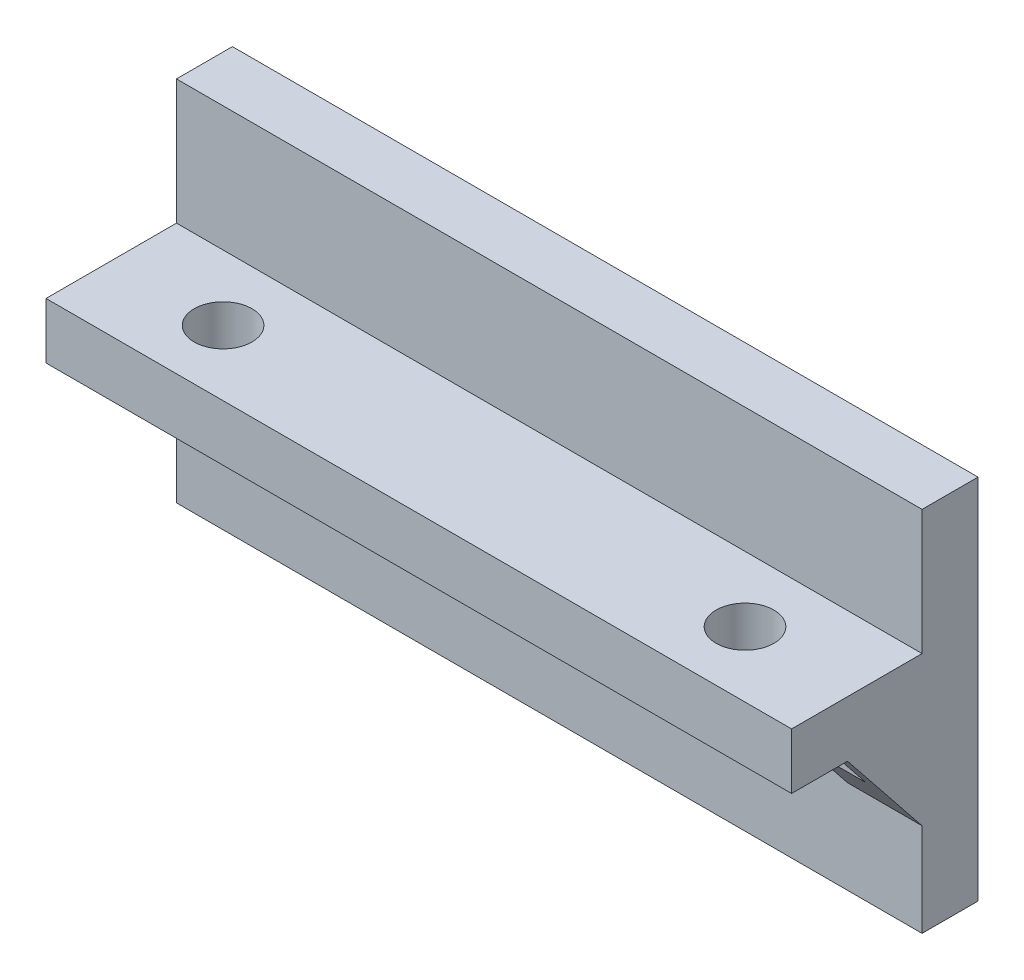
ISO-10303-21;
HEADER;
FILE_DESCRIPTION(('STEP AP214'),'2;1');
FILE_NAME('part.step','',(''),(''),'','','');
FILE_SCHEMA(('AUTOMOTIVE_DESIGN { 1 0 10303 214 1 1 1 1 }'));
ENDSEC;
DATA;
#1=APPLICATION_CONTEXT('core data for automotive mechanical design processes');
#2=APPLICATION_PROTOCOL_DEFINITION('international standard','automotive_design',2000,#1);
#3=PRODUCT_CONTEXT('',#1,'mechanical');
#4=PRODUCT('Part','Part','',(#3));
#5=PRODUCT_RELATED_PRODUCT_CATEGORY('part','',(#4));
#6=PRODUCT_DEFINITION_FORMATION('','',#4);
#7=PRODUCT_DEFINITION_CONTEXT('part definition',#1,'design');
#8=PRODUCT_DEFINITION('design','',#6,#7);
#9=PRODUCT_DEFINITION_SHAPE('','',#8);
#10=(LENGTH_UNIT() NAMED_UNIT(*) SI_UNIT(.MILLI.,.METRE.));
#11=(NAMED_UNIT(*) PLANE_ANGLE_UNIT() SI_UNIT($,.RADIAN.));
#12=(NAMED_UNIT(*) SI_UNIT($,.STERADIAN.) SOLID_ANGLE_UNIT());
#13=UNCERTAINTY_MEASURE_WITH_UNIT(LENGTH_MEASURE(1.E-05),#10,'distance_accuracy_value','');
#14=(GEOMETRIC_REPRESENTATION_CONTEXT(3) GLOBAL_UNCERTAINTY_ASSIGNED_CONTEXT((#13)) GLOBAL_UNIT_ASSIGNED_CONTEXT((#10,
#11,#12)) REPRESENTATION_CONTEXT('',''));
#15=CARTESIAN_POINT('',(0.,0.,0.));
#16=DIRECTION('',(0.,0.,1.));
#17=DIRECTION('',(1.,0.,0.));
#18=AXIS2_PLACEMENT_3D('',#15,#16,#17);
#19=CARTESIAN_POINT('',(0.,10.,10.));
#20=DIRECTION('',(0.,1.,0.));
#21=DIRECTION('',(0.,0.,1.));
#22=AXIS2_PLACEMENT_3D('',#19,#20,#21);
#23=PLANE('',#22);
#24=CARTESIAN_POINT('',(34.,10.,6.50000000000001));
#25=DIRECTION('',(0.,1.,0.));
#26=DIRECTION('',(0.,0.,1.));
#27=AXIS2_PLACEMENT_3D('',#24,#25,#26);
#28=CIRCLE('',#27,1.55);
#29=CARTESIAN_POINT('',(34.,10.,8.05000000000001));
#30=VERTEX_POINT('',#29);
#31=EDGE_CURVE('E313',#30,#30,#28,.T.);
#32=ORIENTED_EDGE('',*,*,#31,.T.);
#33=EDGE_LOOP('',(#32));
#34=FACE_BOUND('',#33,.T.);
#35=CARTESIAN_POINT('',(6.,10.,6.50000000000001));
#36=DIRECTION('',(0.,1.,0.));
#37=DIRECTION('',(0.,0.,1.));
#38=AXIS2_PLACEMENT_3D('',#35,#36,#37);
#39=CIRCLE('',#38,1.55);
#40=CARTESIAN_POINT('',(6.,10.,8.05000000000001));
#41=VERTEX_POINT('',#40);
#42=EDGE_CURVE('E257',#41,#41,#39,.T.);
#43=ORIENTED_EDGE('',*,*,#42,.T.);
#44=EDGE_LOOP('',(#43));
#45=FACE_BOUND('',#44,.T.);
#46=DIRECTION('',(0.,0.,1.));
#47=VECTOR('',#46,1.);
#48=CARTESIAN_POINT('',(39.,10.,0.));
#49=LINE('',#48,#47);
#50=CARTESIAN_POINT('',(39.,10.,5.));
#51=VERTEX_POINT('',#50);
#52=CARTESIAN_POINT('',(39.,10.,7.));
#53=VERTEX_POINT('',#52);
#54=EDGE_CURVE('E361',#51,#53,#49,.T.);
#55=ORIENTED_EDGE('',*,*,#54,.T.);
#56=DIRECTION('',(1.,0.,0.));
#57=VECTOR('',#56,1.);
#58=CARTESIAN_POINT('',(0.,10.,7.));
#59=LINE('',#58,#57);
#60=CARTESIAN_POINT('',(40.,10.,7.));
#61=VERTEX_POINT('',#60);
#62=EDGE_CURVE('E363',#53,#61,#59,.T.);
#63=ORIENTED_EDGE('',*,*,#62,.T.);
#64=DIRECTION('',(0.,0.,-1.));
#65=VECTOR('',#64,1.);
#66=CARTESIAN_POINT('',(40.,10.,10.));
#67=LINE('',#66,#65);
#68=CARTESIAN_POINT('',(40.,10.,10.));
#69=VERTEX_POINT('',#68);
#70=EDGE_CURVE('E212',#69,#61,#67,.T.);
#71=ORIENTED_EDGE('',*,*,#70,.F.);
#72=DIRECTION('',(1.,0.,0.));
#73=VECTOR('',#72,1.);
#74=CARTESIAN_POINT('',(0.,10.,10.));
#75=LINE('',#74,#73);
#76=CARTESIAN_POINT('',(0.,10.,10.));
#77=VERTEX_POINT('',#76);
#78=EDGE_CURVE('E199',#77,#69,#75,.T.);
#79=ORIENTED_EDGE('',*,*,#78,.F.);
#80=DIRECTION('',(0.,0.,-1.));
#81=VECTOR('',#80,1.);
#82=CARTESIAN_POINT('',(0.,10.,10.));
#83=LINE('',#82,#81);
#84=CARTESIAN_POINT('',(0.,10.,7.));
#85=VERTEX_POINT('',#84);
#86=EDGE_CURVE('E190',#77,#85,#83,.T.);
#87=ORIENTED_EDGE('',*,*,#86,.T.);
#88=DIRECTION('',(-1.,0.,0.));
#89=VECTOR('',#88,1.);
#90=CARTESIAN_POINT('',(0.,10.,7.));
#91=LINE('',#90,#89);
#92=CARTESIAN_POINT('',(1.,10.,7.));
#93=VERTEX_POINT('',#92);
#94=EDGE_CURVE('E175',#93,#85,#91,.T.);
#95=ORIENTED_EDGE('',*,*,#94,.F.);
#96=DIRECTION('',(0.,0.,1.));
#97=VECTOR('',#96,1.);
#98=CARTESIAN_POINT('',(1.,10.,0.));
#99=LINE('',#98,#97);
#100=CARTESIAN_POINT('',(1.,10.,5.));
#101=VERTEX_POINT('',#100);
#102=EDGE_CURVE('E184',#101,#93,#99,.T.);
#103=ORIENTED_EDGE('',*,*,#102,.F.);
#104=DIRECTION('',(1.,0.,0.));
#105=VECTOR('',#104,1.);
#106=CARTESIAN_POINT('',(0.,10.,5.));
#107=LINE('',#106,#105);
#108=CARTESIAN_POINT('',(4.,10.,5.));
#109=VERTEX_POINT('',#108);
#110=EDGE_CURVE('E348',#101,#109,#107,.T.);
#111=ORIENTED_EDGE('',*,*,#110,.T.);
#112=DIRECTION('',(0.,0.,-1.));
#113=VECTOR('',#112,1.);
#114=CARTESIAN_POINT('',(4.,10.,0.));
#115=LINE('',#114,#113);
#116=CARTESIAN_POINT('',(4.,10.,3.));
#117=VERTEX_POINT('',#116);
#118=EDGE_CURVE('E350',#109,#117,#115,.T.);
#119=ORIENTED_EDGE('',*,*,#118,.T.);
#120=DIRECTION('',(1.,0.,0.));
#121=VECTOR('',#120,1.);
#122=CARTESIAN_POINT('',(0.,10.,3.));
#123=LINE('',#122,#121);
#124=CARTESIAN_POINT('',(17.5,10.,3.));
#125=VERTEX_POINT('',#124);
#126=EDGE_CURVE('E291',#117,#125,#123,.T.);
#127=ORIENTED_EDGE('',*,*,#126,.T.);
#128=DIRECTION('',(0.,0.,-1.));
#129=VECTOR('',#128,1.);
#130=CARTESIAN_POINT('',(17.5,10.,0.));
#131=LINE('',#130,#129);
#132=CARTESIAN_POINT('',(17.5,10.,5.));
#133=VERTEX_POINT('',#132);
#134=EDGE_CURVE('E332',#133,#125,#131,.T.);
#135=ORIENTED_EDGE('',*,*,#134,.F.);
#136=DIRECTION('',(1.,0.,0.));
#137=VECTOR('',#136,1.);
#138=CARTESIAN_POINT('',(0.,10.,5.));
#139=LINE('',#138,#137);
#140=CARTESIAN_POINT('',(23.5,10.,5.));
#141=VERTEX_POINT('',#140);
#142=EDGE_CURVE('E335',#133,#141,#139,.T.);
#143=ORIENTED_EDGE('',*,*,#142,.T.);
#144=DIRECTION('',(0.,0.,1.));
#145=VECTOR('',#144,1.);
#146=CARTESIAN_POINT('',(23.5,10.,0.));
#147=LINE('',#146,#145);
#148=CARTESIAN_POINT('',(23.5,10.,3.));
#149=VERTEX_POINT('',#148);
#150=EDGE_CURVE('E338',#149,#141,#147,.T.);
#151=ORIENTED_EDGE('',*,*,#150,.F.);
#152=CARTESIAN_POINT('',(36.,10.,3.));
#153=VERTEX_POINT('',#152);
#154=EDGE_CURVE('E293',#149,#153,#123,.T.);
#155=ORIENTED_EDGE('',*,*,#154,.T.);
#156=DIRECTION('',(0.,0.,-1.));
#157=VECTOR('',#156,1.);
#158=CARTESIAN_POINT('',(36.,10.,0.));
#159=LINE('',#158,#157);
#160=CARTESIAN_POINT('',(36.,10.,5.));
#161=VERTEX_POINT('',#160);
#162=EDGE_CURVE('E366',#161,#153,#159,.T.);
#163=ORIENTED_EDGE('',*,*,#162,.F.);
#164=DIRECTION('',(1.,0.,0.));
#165=VECTOR('',#164,1.);
#166=CARTESIAN_POINT('',(0.,10.,5.));
#167=LINE('',#166,#165);
#168=EDGE_CURVE('E368',#161,#51,#167,.T.);
#169=ORIENTED_EDGE('',*,*,#168,.T.);
#170=EDGE_LOOP('',(#55,#63,#71,#79,#87,#95,#103,#111,#119,#127,#135,#143,#151,#155,#163,#169));
#171=FACE_BOUND('',#170,.T.);
#172=ADVANCED_FACE('F36',(#34,#45,#171),#23,.F.);
#173=CARTESIAN_POINT('',(0.,0.,3.));
#174=DIRECTION('',(0.,0.,1.));
#175=DIRECTION('',(1.,0.,0.));
#176=AXIS2_PLACEMENT_3D('',#173,#174,#175);
#177=PLANE('',#176);
#178=CARTESIAN_POINT('',(30.,5.,3.));
#179=DIRECTION('',(0.,0.,1.));
#180=DIRECTION('',(1.,0.,0.));
#181=AXIS2_PLACEMENT_3D('',#178,#179,#180);
#182=CIRCLE('',#181,1.55);
#183=CARTESIAN_POINT('',(31.55,5.,3.));
#184=VERTEX_POINT('',#183);
#185=EDGE_CURVE('E264',#184,#184,#182,.T.);
#186=ORIENTED_EDGE('',*,*,#185,.F.);
#187=EDGE_LOOP('',(#186));
#188=FACE_BOUND('',#187,.T.);
#189=CARTESIAN_POINT('',(10.,5.,3.));
#190=DIRECTION('',(0.,0.,1.));
#191=DIRECTION('',(1.,0.,0.));
#192=AXIS2_PLACEMENT_3D('',#189,#190,#191);
#193=CIRCLE('',#192,1.55);
#194=CARTESIAN_POINT('',(11.55,5.,3.));
#195=VERTEX_POINT('',#194);
#196=EDGE_CURVE('E254',#195,#195,#193,.T.);
#197=ORIENTED_EDGE('',*,*,#196,.F.);
#198=EDGE_LOOP('',(#197));
#199=FACE_BOUND('',#198,.T.);
#200=DIRECTION('',(1.,0.,0.));
#201=VECTOR('',#200,1.);
#202=CARTESIAN_POINT('',(0.,5.,3.));
#203=LINE('',#202,#201);
#204=CARTESIAN_POINT('',(17.5,5.,3.));
#205=VERTEX_POINT('',#204);
#206=CARTESIAN_POINT('',(23.5,5.,3.));
#207=VERTEX_POINT('',#206);
#208=EDGE_CURVE('E331',#205,#207,#203,.T.);
#209=ORIENTED_EDGE('',*,*,#208,.F.);
#210=DIRECTION('',(0.,1.,0.));
#211=VECTOR('',#210,1.);
#212=CARTESIAN_POINT('',(17.5,5.,3.));
#213=LINE('',#212,#211);
#214=EDGE_CURVE('E328',#205,#125,#213,.T.);
#215=ORIENTED_EDGE('',*,*,#214,.T.);
#216=ORIENTED_EDGE('',*,*,#126,.F.);
#217=DIRECTION('',(0.,1.,0.));
#218=VECTOR('',#217,1.);
#219=CARTESIAN_POINT('',(4.,5.,3.));
#220=LINE('',#219,#218);
#221=CARTESIAN_POINT('',(4.,5.,3.));
#222=VERTEX_POINT('',#221);
#223=EDGE_CURVE('E344',#222,#117,#220,.T.);
#224=ORIENTED_EDGE('',*,*,#223,.F.);
#225=DIRECTION('',(1.,0.,0.));
#226=VECTOR('',#225,1.);
#227=CARTESIAN_POINT('',(0.,5.,3.));
#228=LINE('',#227,#226);
#229=CARTESIAN_POINT('',(0.,5.,3.));
#230=VERTEX_POINT('',#229);
#231=EDGE_CURVE('E183',#230,#222,#228,.T.);
#232=ORIENTED_EDGE('',*,*,#231,.F.);
#233=DIRECTION('',(0.,1.,0.));
#234=VECTOR('',#233,1.);
#235=CARTESIAN_POINT('',(0.,0.,3.));
#236=LINE('',#235,#234);
#237=CARTESIAN_POINT('',(0.,0.,3.));
#238=VERTEX_POINT('',#237);
#239=EDGE_CURVE('E193',#238,#230,#236,.T.);
#240=ORIENTED_EDGE('',*,*,#239,.F.);
#241=DIRECTION('',(1.,0.,0.));
#242=VECTOR('',#241,1.);
#243=CARTESIAN_POINT('',(0.,0.,3.));
#244=LINE('',#243,#242);
#245=CARTESIAN_POINT('',(40.,0.,3.));
#246=VERTEX_POINT('',#245);
#247=EDGE_CURVE('E285',#238,#246,#244,.T.);
#248=ORIENTED_EDGE('',*,*,#247,.T.);
#249=DIRECTION('',(0.,1.,0.));
#250=VECTOR('',#249,1.);
#251=CARTESIAN_POINT('',(40.,0.,3.));
#252=LINE('',#251,#250);
#253=CARTESIAN_POINT('',(40.,5.,3.));
#254=VERTEX_POINT('',#253);
#255=EDGE_CURVE('E282',#246,#254,#252,.T.);
#256=ORIENTED_EDGE('',*,*,#255,.T.);
#257=DIRECTION('',(1.,0.,0.));
#258=VECTOR('',#257,1.);
#259=CARTESIAN_POINT('',(0.,5.,3.));
#260=LINE('',#259,#258);
#261=CARTESIAN_POINT('',(36.,5.,3.));
#262=VERTEX_POINT('',#261);
#263=EDGE_CURVE('E360',#262,#254,#260,.T.);
#264=ORIENTED_EDGE('',*,*,#263,.F.);
#265=DIRECTION('',(0.,1.,0.));
#266=VECTOR('',#265,1.);
#267=CARTESIAN_POINT('',(36.,5.,3.));
#268=LINE('',#267,#266);
#269=EDGE_CURVE('E355',#262,#153,#268,.T.);
#270=ORIENTED_EDGE('',*,*,#269,.T.);
#271=ORIENTED_EDGE('',*,*,#154,.F.);
#272=DIRECTION('',(0.,1.,0.));
#273=VECTOR('',#272,1.);
#274=CARTESIAN_POINT('',(23.5,5.,3.));
#275=LINE('',#274,#273);
#276=EDGE_CURVE('E314',#207,#149,#275,.T.);
#277=ORIENTED_EDGE('',*,*,#276,.F.);
#278=EDGE_LOOP('',(#209,#215,#216,#224,#232,#240,#248,#256,#264,#270,#271,#277));
#279=FACE_BOUND('',#278,.T.);
#280=ADVANCED_FACE('F289',(#188,#199,#279),#177,.T.);
#281=CARTESIAN_POINT('',(40.,0.,3.));
#282=DIRECTION('',(-1.,0.,0.));
#283=DIRECTION('',(0.,0.,1.));
#284=AXIS2_PLACEMENT_3D('',#281,#282,#283);
#285=PLANE('',#284);
#286=ORIENTED_EDGE('',*,*,#70,.T.);
#287=DIRECTION('',(0.,-0.78086880944303,-0.624695047554424));
#288=VECTOR('',#287,1.);
#289=CARTESIAN_POINT('',(40.,1.95121951219512,0.560975609756097));
#290=LINE('',#289,#288);
#291=EDGE_CURVE('E371',#61,#254,#290,.T.);
#292=ORIENTED_EDGE('',*,*,#291,.T.);
#293=ORIENTED_EDGE('',*,*,#255,.F.);
#294=DIRECTION('',(0.,0.,-1.));
#295=VECTOR('',#294,1.);
#296=CARTESIAN_POINT('',(40.,0.,3.));
#297=LINE('',#296,#295);
#298=CARTESIAN_POINT('',(40.,0.,0.));
#299=VERTEX_POINT('',#298);
#300=EDGE_CURVE('E261',#246,#299,#297,.T.);
#301=ORIENTED_EDGE('',*,*,#300,.T.);
#302=DIRECTION('',(0.,1.,0.));
#303=VECTOR('',#302,1.);
#304=CARTESIAN_POINT('',(40.,0.,0.));
#305=LINE('',#304,#303);
#306=CARTESIAN_POINT('',(40.,19.7,0.));
#307=VERTEX_POINT('',#306);
#308=EDGE_CURVE('E215',#299,#307,#305,.T.);
#309=ORIENTED_EDGE('',*,*,#308,.T.);
#310=DIRECTION('',(0.,0.,-1.));
#311=VECTOR('',#310,1.);
#312=CARTESIAN_POINT('',(40.,19.7,3.));
#313=LINE('',#312,#311);
#314=CARTESIAN_POINT('',(40.,19.7,3.));
#315=VERTEX_POINT('',#314);
#316=EDGE_CURVE('E11',#315,#307,#313,.T.);
#317=ORIENTED_EDGE('',*,*,#316,.F.);
#318=DIRECTION('',(0.,1.,0.));
#319=VECTOR('',#318,1.);
#320=CARTESIAN_POINT('',(40.,0.,3.));
#321=LINE('',#320,#319);
#322=CARTESIAN_POINT('',(40.,13.,3.));
#323=VERTEX_POINT('',#322);
#324=EDGE_CURVE('E219',#323,#315,#321,.T.);
#325=ORIENTED_EDGE('',*,*,#324,.F.);
#326=DIRECTION('',(0.,0.,-1.));
#327=VECTOR('',#326,1.);
#328=CARTESIAN_POINT('',(40.,13.,10.));
#329=LINE('',#328,#327);
#330=CARTESIAN_POINT('',(40.,13.,10.));
#331=VERTEX_POINT('',#330);
#332=EDGE_CURVE('E205',#331,#323,#329,.T.);
#333=ORIENTED_EDGE('',*,*,#332,.F.);
#334=DIRECTION('',(0.,1.,0.));
#335=VECTOR('',#334,1.);
#336=CARTESIAN_POINT('',(40.,0.,10.));
#337=LINE('',#336,#335);
#338=EDGE_CURVE('E267',#69,#331,#337,.T.);
#339=ORIENTED_EDGE('',*,*,#338,.F.);
#340=EDGE_LOOP('',(#286,#292,#293,#301,#309,#317,#325,#333,#339));
#341=FACE_BOUND('',#340,.T.);
#342=ADVANCED_FACE('F38',(#341),#285,.F.);
#343=CARTESIAN_POINT('',(0.,19.7,3.));
#344=DIRECTION('',(0.,1.,0.));
#345=DIRECTION('',(0.,0.,1.));
#346=AXIS2_PLACEMENT_3D('',#343,#344,#345);
#347=PLANE('',#346);
#348=DIRECTION('',(1.,0.,0.));
#349=VECTOR('',#348,1.);
#350=CARTESIAN_POINT('',(0.,19.7,0.));
#351=LINE('',#350,#349);
#352=CARTESIAN_POINT('',(0.,19.7,0.));
#353=VERTEX_POINT('',#352);
#354=EDGE_CURVE('E230',#353,#307,#351,.T.);
#355=ORIENTED_EDGE('',*,*,#354,.F.);
#356=DIRECTION('',(0.,0.,-1.));
#357=VECTOR('',#356,1.);
#358=CARTESIAN_POINT('',(0.,19.7,3.));
#359=LINE('',#358,#357);
#360=CARTESIAN_POINT('',(0.,19.7,3.));
#361=VERTEX_POINT('',#360);
#362=EDGE_CURVE('E44',#361,#353,#359,.T.);
#363=ORIENTED_EDGE('',*,*,#362,.F.);
#364=DIRECTION('',(1.,0.,0.));
#365=VECTOR('',#364,1.);
#366=CARTESIAN_POINT('',(0.,19.7,3.));
#367=LINE('',#366,#365);
#368=EDGE_CURVE('E222',#361,#315,#367,.T.);
#369=ORIENTED_EDGE('',*,*,#368,.T.);
#370=ORIENTED_EDGE('',*,*,#316,.T.);
#371=EDGE_LOOP('',(#355,#363,#369,#370));
#372=FACE_BOUND('',#371,.T.);
#373=ADVANCED_FACE('F239',(#372),#347,.T.);
#374=CARTESIAN_POINT('',(0.,0.,3.));
#375=DIRECTION('',(-1.,0.,0.));
#376=DIRECTION('',(0.,0.,1.));
#377=AXIS2_PLACEMENT_3D('',#374,#375,#376);
#378=PLANE('',#377);
#379=DIRECTION('',(0.,-0.78086880944303,-0.624695047554424));
#380=VECTOR('',#379,1.);
#381=CARTESIAN_POINT('',(0.,10.,7.));
#382=LINE('',#381,#380);
#383=EDGE_CURVE('E178',#85,#230,#382,.T.);
#384=ORIENTED_EDGE('',*,*,#383,.F.);
#385=ORIENTED_EDGE('',*,*,#86,.F.);
#386=DIRECTION('',(0.,1.,0.));
#387=VECTOR('',#386,1.);
#388=CARTESIAN_POINT('',(0.,0.,10.));
#389=LINE('',#388,#387);
#390=CARTESIAN_POINT('',(0.,13.,10.));
#391=VERTEX_POINT('',#390);
#392=EDGE_CURVE('E202',#77,#391,#389,.T.);
#393=ORIENTED_EDGE('',*,*,#392,.T.);
#394=DIRECTION('',(0.,0.,-1.));
#395=VECTOR('',#394,1.);
#396=CARTESIAN_POINT('',(0.,13.,10.));
#397=LINE('',#396,#395);
#398=CARTESIAN_POINT('',(0.,13.,3.));
#399=VERTEX_POINT('',#398);
#400=EDGE_CURVE('E201',#391,#399,#397,.T.);
#401=ORIENTED_EDGE('',*,*,#400,.T.);
#402=DIRECTION('',(0.,1.,0.));
#403=VECTOR('',#402,1.);
#404=CARTESIAN_POINT('',(0.,0.,3.));
#405=LINE('',#404,#403);
#406=EDGE_CURVE('E225',#399,#361,#405,.T.);
#407=ORIENTED_EDGE('',*,*,#406,.T.);
#408=ORIENTED_EDGE('',*,*,#362,.T.);
#409=DIRECTION('',(0.,1.,0.));
#410=VECTOR('',#409,1.);
#411=CARTESIAN_POINT('',(0.,0.,0.));
#412=LINE('',#411,#410);
#413=CARTESIAN_POINT('',(0.,0.,0.));
#414=VERTEX_POINT('',#413);
#415=EDGE_CURVE('E220',#414,#353,#412,.T.);
#416=ORIENTED_EDGE('',*,*,#415,.F.);
#417=DIRECTION('',(0.,0.,-1.));
#418=VECTOR('',#417,1.);
#419=CARTESIAN_POINT('',(0.,0.,3.));
#420=LINE('',#419,#418);
#421=EDGE_CURVE('E263',#238,#414,#420,.T.);
#422=ORIENTED_EDGE('',*,*,#421,.F.);
#423=ORIENTED_EDGE('',*,*,#239,.T.);
#424=EDGE_LOOP('',(#384,#385,#393,#401,#407,#408,#416,#422,#423));
#425=FACE_BOUND('',#424,.T.);
#426=ADVANCED_FACE('F188',(#425),#378,.T.);
#427=CARTESIAN_POINT('',(0.,0.,3.));
#428=DIRECTION('',(0.,0.,1.));
#429=DIRECTION('',(1.,0.,0.));
#430=AXIS2_PLACEMENT_3D('',#427,#428,#429);
#431=PLANE('',#430);
#432=DIRECTION('',(1.,0.,0.));
#433=VECTOR('',#432,1.);
#434=CARTESIAN_POINT('',(0.,13.,3.));
#435=LINE('',#434,#433);
#436=EDGE_CURVE('E216',#399,#323,#435,.T.);
#437=ORIENTED_EDGE('',*,*,#436,.T.);
#438=ORIENTED_EDGE('',*,*,#324,.T.);
#439=ORIENTED_EDGE('',*,*,#368,.F.);
#440=ORIENTED_EDGE('',*,*,#406,.F.);
#441=EDGE_LOOP('',(#437,#438,#439,#440));
#442=FACE_BOUND('',#441,.T.);
#443=ADVANCED_FACE('F277',(#442),#431,.T.);
#444=CARTESIAN_POINT('',(0.,0.,0.));
#445=DIRECTION('',(0.,0.,1.));
#446=DIRECTION('',(1.,0.,0.));
#447=AXIS2_PLACEMENT_3D('',#444,#445,#446);
#448=PLANE('',#447);
#449=ORIENTED_EDGE('',*,*,#308,.F.);
#450=DIRECTION('',(1.,0.,0.));
#451=VECTOR('',#450,1.);
#452=CARTESIAN_POINT('',(0.,0.,0.));
#453=LINE('',#452,#451);
#454=EDGE_CURVE('E246',#414,#299,#453,.T.);
#455=ORIENTED_EDGE('',*,*,#454,.F.);
#456=ORIENTED_EDGE('',*,*,#415,.T.);
#457=ORIENTED_EDGE('',*,*,#354,.T.);
#458=EDGE_LOOP('',(#449,#455,#456,#457));
#459=FACE_BOUND('',#458,.T.);
#460=CARTESIAN_POINT('',(10.,5.,0.));
#461=DIRECTION('',(0.,0.,1.));
#462=DIRECTION('',(1.,0.,0.));
#463=AXIS2_PLACEMENT_3D('',#460,#461,#462);
#464=CIRCLE('',#463,1.55);
#465=CARTESIAN_POINT('',(11.55,5.,0.));
#466=VERTEX_POINT('',#465);
#467=EDGE_CURVE('E251',#466,#466,#464,.T.);
#468=ORIENTED_EDGE('',*,*,#467,.T.);
#469=EDGE_LOOP('',(#468));
#470=FACE_BOUND('',#469,.T.);
#471=CARTESIAN_POINT('',(30.,5.,0.));
#472=DIRECTION('',(0.,0.,1.));
#473=DIRECTION('',(1.,0.,0.));
#474=AXIS2_PLACEMENT_3D('',#471,#472,#473);
#475=CIRCLE('',#474,1.55);
#476=CARTESIAN_POINT('',(31.55,5.,0.));
#477=VERTEX_POINT('',#476);
#478=EDGE_CURVE('E250',#477,#477,#475,.T.);
#479=ORIENTED_EDGE('',*,*,#478,.T.);
#480=EDGE_LOOP('',(#479));
#481=FACE_BOUND('',#480,.T.);
#482=ADVANCED_FACE('F243',(#459,#470,#481),#448,.F.);
#483=CARTESIAN_POINT('',(0.,13.,10.));
#484=DIRECTION('',(0.,1.,0.));
#485=DIRECTION('',(0.,0.,1.));
#486=AXIS2_PLACEMENT_3D('',#483,#484,#485);
#487=PLANE('',#486);
#488=CARTESIAN_POINT('',(6.,13.,6.50000000000001));
#489=DIRECTION('',(0.,1.,0.));
#490=DIRECTION('',(0.,0.,1.));
#491=AXIS2_PLACEMENT_3D('',#488,#489,#490);
#492=CIRCLE('',#491,1.55);
#493=CARTESIAN_POINT('',(6.,13.,8.05000000000001));
#494=VERTEX_POINT('',#493);
#495=EDGE_CURVE('E317',#494,#494,#492,.T.);
#496=ORIENTED_EDGE('',*,*,#495,.F.);
#497=EDGE_LOOP('',(#496));
#498=FACE_BOUND('',#497,.T.);
#499=CARTESIAN_POINT('',(34.,13.,6.50000000000001));
#500=DIRECTION('',(0.,1.,0.));
#501=DIRECTION('',(0.,0.,1.));
#502=AXIS2_PLACEMENT_3D('',#499,#500,#501);
#503=CIRCLE('',#502,1.55);
#504=CARTESIAN_POINT('',(34.,13.,8.05000000000001));
#505=VERTEX_POINT('',#504);
#506=EDGE_CURVE('E310',#505,#505,#503,.T.);
#507=ORIENTED_EDGE('',*,*,#506,.F.);
#508=EDGE_LOOP('',(#507));
#509=FACE_BOUND('',#508,.T.);
#510=ORIENTED_EDGE('',*,*,#436,.F.);
#511=ORIENTED_EDGE('',*,*,#400,.F.);
#512=DIRECTION('',(1.,0.,0.));
#513=VECTOR('',#512,1.);
#514=CARTESIAN_POINT('',(0.,13.,10.));
#515=LINE('',#514,#513);
#516=EDGE_CURVE('E207',#391,#331,#515,.T.);
#517=ORIENTED_EDGE('',*,*,#516,.T.);
#518=ORIENTED_EDGE('',*,*,#332,.T.);
#519=EDGE_LOOP('',(#510,#511,#517,#518));
#520=FACE_BOUND('',#519,.T.);
#521=ADVANCED_FACE('F271',(#498,#509,#520),#487,.T.);
#522=CARTESIAN_POINT('',(0.,0.,10.));
#523=DIRECTION('',(0.,0.,1.));
#524=DIRECTION('',(1.,0.,0.));
#525=AXIS2_PLACEMENT_3D('',#522,#523,#524);
#526=PLANE('',#525);
#527=ORIENTED_EDGE('',*,*,#78,.T.);
#528=ORIENTED_EDGE('',*,*,#338,.T.);
#529=ORIENTED_EDGE('',*,*,#516,.F.);
#530=ORIENTED_EDGE('',*,*,#392,.F.);
#531=EDGE_LOOP('',(#527,#528,#529,#530));
#532=FACE_BOUND('',#531,.T.);
#533=ADVANCED_FACE('F275',(#532),#526,.T.);
#534=CARTESIAN_POINT('',(0.,0.,3.));
#535=DIRECTION('',(0.,1.,0.));
#536=DIRECTION('',(0.,0.,1.));
#537=AXIS2_PLACEMENT_3D('',#534,#535,#536);
#538=PLANE('',#537);
#539=ORIENTED_EDGE('',*,*,#454,.T.);
#540=ORIENTED_EDGE('',*,*,#300,.F.);
#541=ORIENTED_EDGE('',*,*,#247,.F.);
#542=ORIENTED_EDGE('',*,*,#421,.T.);
#543=EDGE_LOOP('',(#539,#540,#541,#542));
#544=FACE_BOUND('',#543,.T.);
#545=ADVANCED_FACE('F284',(#544),#538,.F.);
#546=CARTESIAN_POINT('',(10.,5.,3.));
#547=DIRECTION('',(0.,0.,-1.));
#548=DIRECTION('',(-1.,0.,0.));
#549=AXIS2_PLACEMENT_3D('',#546,#547,#548);
#550=CYLINDRICAL_SURFACE('',#549,1.55);
#551=ORIENTED_EDGE('',*,*,#196,.T.);
#552=EDGE_LOOP('',(#551));
#553=FACE_BOUND('',#552,.T.);
#554=ORIENTED_EDGE('',*,*,#467,.F.);
#555=EDGE_LOOP('',(#554));
#556=FACE_BOUND('',#555,.T.);
#557=ADVANCED_FACE('F493',(#553,#556),#550,.F.);
#558=CARTESIAN_POINT('',(30.,5.,3.));
#559=DIRECTION('',(0.,0.,-1.));
#560=DIRECTION('',(-1.,0.,0.));
#561=AXIS2_PLACEMENT_3D('',#558,#559,#560);
#562=CYLINDRICAL_SURFACE('',#561,1.55);
#563=ORIENTED_EDGE('',*,*,#185,.T.);
#564=EDGE_LOOP('',(#563));
#565=FACE_BOUND('',#564,.T.);
#566=ORIENTED_EDGE('',*,*,#478,.F.);
#567=EDGE_LOOP('',(#566));
#568=FACE_BOUND('',#567,.T.);
#569=ADVANCED_FACE('F299',(#565,#568),#562,.F.);
#570=CARTESIAN_POINT('',(34.,10.,6.50000000000001));
#571=DIRECTION('',(0.,1.,0.));
#572=DIRECTION('',(0.,0.,1.));
#573=AXIS2_PLACEMENT_3D('',#570,#571,#572);
#574=CYLINDRICAL_SURFACE('',#573,1.55);
#575=ORIENTED_EDGE('',*,*,#31,.F.);
#576=EDGE_LOOP('',(#575));
#577=FACE_BOUND('',#576,.T.);
#578=ORIENTED_EDGE('',*,*,#506,.T.);
#579=EDGE_LOOP('',(#578));
#580=FACE_BOUND('',#579,.T.);
#581=ADVANCED_FACE('F682',(#577,#580),#574,.F.);
#582=CARTESIAN_POINT('',(6.,10.,6.50000000000001));
#583=DIRECTION('',(0.,1.,0.));
#584=DIRECTION('',(0.,0.,1.));
#585=AXIS2_PLACEMENT_3D('',#582,#583,#584);
#586=CYLINDRICAL_SURFACE('',#585,1.55);
#587=ORIENTED_EDGE('',*,*,#42,.F.);
#588=EDGE_LOOP('',(#587));
#589=FACE_BOUND('',#588,.T.);
#590=ORIENTED_EDGE('',*,*,#495,.T.);
#591=EDGE_LOOP('',(#590));
#592=FACE_BOUND('',#591,.T.);
#593=ADVANCED_FACE('F579',(#589,#592),#586,.F.);
#594=CARTESIAN_POINT('',(23.5,5.,0.));
#595=DIRECTION('',(-1.,0.,0.));
#596=DIRECTION('',(0.,0.,1.));
#597=AXIS2_PLACEMENT_3D('',#594,#595,#596);
#598=PLANE('',#597);
#599=DIRECTION('',(0.,1.,0.));
#600=VECTOR('',#599,1.);
#601=CARTESIAN_POINT('',(23.5,5.,5.));
#602=LINE('',#601,#600);
#603=CARTESIAN_POINT('',(23.5,7.5,5.));
#604=VERTEX_POINT('',#603);
#605=EDGE_CURVE('E324',#604,#141,#602,.T.);
#606=ORIENTED_EDGE('',*,*,#605,.F.);
#607=DIRECTION('',(0.,-0.78086880944303,-0.624695047554424));
#608=VECTOR('',#607,1.);
#609=CARTESIAN_POINT('',(23.5,3.53658536585366,1.82926829268293));
#610=LINE('',#609,#608);
#611=EDGE_CURVE('E374',#604,#207,#610,.T.);
#612=ORIENTED_EDGE('',*,*,#611,.T.);
#613=ORIENTED_EDGE('',*,*,#276,.T.);
#614=ORIENTED_EDGE('',*,*,#150,.T.);
#615=EDGE_LOOP('',(#606,#612,#613,#614));
#616=FACE_BOUND('',#615,.T.);
#617=ADVANCED_FACE('F414',(#616),#598,.F.);
#618=CARTESIAN_POINT('',(0.,5.,5.));
#619=DIRECTION('',(0.,0.,1.));
#620=DIRECTION('',(1.,0.,0.));
#621=AXIS2_PLACEMENT_3D('',#618,#619,#620);
#622=PLANE('',#621);
#623=DIRECTION('',(-1.,0.,0.));
#624=VECTOR('',#623,1.);
#625=CARTESIAN_POINT('',(0.,7.5,5.));
#626=LINE('',#625,#624);
#627=CARTESIAN_POINT('',(17.5,7.5,5.));
#628=VERTEX_POINT('',#627);
#629=EDGE_CURVE('E377',#604,#628,#626,.T.);
#630=ORIENTED_EDGE('',*,*,#629,.F.);
#631=ORIENTED_EDGE('',*,*,#605,.T.);
#632=ORIENTED_EDGE('',*,*,#142,.F.);
#633=DIRECTION('',(0.,1.,0.));
#634=VECTOR('',#633,1.);
#635=CARTESIAN_POINT('',(17.5,5.,5.));
#636=LINE('',#635,#634);
#637=EDGE_CURVE('E326',#628,#133,#636,.T.);
#638=ORIENTED_EDGE('',*,*,#637,.F.);
#639=EDGE_LOOP('',(#630,#631,#632,#638));
#640=FACE_BOUND('',#639,.T.);
#641=ADVANCED_FACE('F420',(#640),#622,.T.);
#642=CARTESIAN_POINT('',(17.5,5.,0.));
#643=DIRECTION('',(1.,0.,0.));
#644=DIRECTION('',(0.,0.,-1.));
#645=AXIS2_PLACEMENT_3D('',#642,#643,#644);
#646=PLANE('',#645);
#647=ORIENTED_EDGE('',*,*,#214,.F.);
#648=DIRECTION('',(0.,0.78086880944303,0.624695047554424));
#649=VECTOR('',#648,1.);
#650=CARTESIAN_POINT('',(17.5,3.53658536585366,1.82926829268293));
#651=LINE('',#650,#649);
#652=EDGE_CURVE('E379',#205,#628,#651,.T.);
#653=ORIENTED_EDGE('',*,*,#652,.T.);
#654=ORIENTED_EDGE('',*,*,#637,.T.);
#655=ORIENTED_EDGE('',*,*,#134,.T.);
#656=EDGE_LOOP('',(#647,#653,#654,#655));
#657=FACE_BOUND('',#656,.T.);
#658=ADVANCED_FACE('F425',(#657),#646,.F.);
#659=CARTESIAN_POINT('',(4.,5.,0.));
#660=DIRECTION('',(1.,0.,0.));
#661=DIRECTION('',(0.,0.,-1.));
#662=AXIS2_PLACEMENT_3D('',#659,#660,#661);
#663=PLANE('',#662);
#664=DIRECTION('',(0.,0.78086880944303,0.624695047554424));
#665=VECTOR('',#664,1.);
#666=CARTESIAN_POINT('',(4.,3.53658536585366,1.82926829268293));
#667=LINE('',#666,#665);
#668=CARTESIAN_POINT('',(4.,7.5,5.));
#669=VERTEX_POINT('',#668);
#670=EDGE_CURVE('E382',#222,#669,#667,.T.);
#671=ORIENTED_EDGE('',*,*,#670,.F.);
#672=ORIENTED_EDGE('',*,*,#223,.T.);
#673=ORIENTED_EDGE('',*,*,#118,.F.);
#674=DIRECTION('',(0.,1.,0.));
#675=VECTOR('',#674,1.);
#676=CARTESIAN_POINT('',(4.,5.,5.));
#677=LINE('',#676,#675);
#678=EDGE_CURVE('E51',#669,#109,#677,.T.);
#679=ORIENTED_EDGE('',*,*,#678,.F.);
#680=EDGE_LOOP('',(#671,#672,#673,#679));
#681=FACE_BOUND('',#680,.T.);
#682=ADVANCED_FACE('F430',(#681),#663,.T.);
#683=CARTESIAN_POINT('',(0.,5.,5.));
#684=DIRECTION('',(0.,0.,1.));
#685=DIRECTION('',(1.,0.,0.));
#686=AXIS2_PLACEMENT_3D('',#683,#684,#685);
#687=PLANE('',#686);
#688=DIRECTION('',(-1.,0.,0.));
#689=VECTOR('',#688,1.);
#690=CARTESIAN_POINT('',(0.,7.5,5.));
#691=LINE('',#690,#689);
#692=CARTESIAN_POINT('',(1.,7.5,5.));
#693=VERTEX_POINT('',#692);
#694=EDGE_CURVE('E384',#669,#693,#691,.T.);
#695=ORIENTED_EDGE('',*,*,#694,.F.);
#696=ORIENTED_EDGE('',*,*,#678,.T.);
#697=ORIENTED_EDGE('',*,*,#110,.F.);
#698=DIRECTION('',(0.,1.,0.));
#699=VECTOR('',#698,1.);
#700=CARTESIAN_POINT('',(1.,5.,5.));
#701=LINE('',#700,#699);
#702=EDGE_CURVE('E59',#693,#101,#701,.T.);
#703=ORIENTED_EDGE('',*,*,#702,.F.);
#704=EDGE_LOOP('',(#695,#696,#697,#703));
#705=FACE_BOUND('',#704,.T.);
#706=ADVANCED_FACE('F431',(#705),#687,.T.);
#707=CARTESIAN_POINT('',(1.,5.,0.));
#708=DIRECTION('',(-1.,0.,0.));
#709=DIRECTION('',(0.,0.,1.));
#710=AXIS2_PLACEMENT_3D('',#707,#708,#709);
#711=PLANE('',#710);
#712=ORIENTED_EDGE('',*,*,#102,.T.);
#713=DIRECTION('',(0.,-0.78086880944303,-0.624695047554424));
#714=VECTOR('',#713,1.);
#715=CARTESIAN_POINT('',(1.,3.53658536585366,1.82926829268293));
#716=LINE('',#715,#714);
#717=EDGE_CURVE('E180',#93,#693,#716,.T.);
#718=ORIENTED_EDGE('',*,*,#717,.T.);
#719=ORIENTED_EDGE('',*,*,#702,.T.);
#720=EDGE_LOOP('',(#712,#718,#719));
#721=FACE_BOUND('',#720,.T.);
#722=ADVANCED_FACE('F432',(#721),#711,.F.);
#723=CARTESIAN_POINT('',(0.,5.,5.));
#724=DIRECTION('',(0.,0.,1.));
#725=DIRECTION('',(1.,0.,0.));
#726=AXIS2_PLACEMENT_3D('',#723,#724,#725);
#727=PLANE('',#726);
#728=DIRECTION('',(-1.,0.,0.));
#729=VECTOR('',#728,1.);
#730=CARTESIAN_POINT('',(0.,7.5,5.));
#731=LINE('',#730,#729);
#732=CARTESIAN_POINT('',(39.,7.5,5.));
#733=VERTEX_POINT('',#732);
#734=CARTESIAN_POINT('',(36.,7.5,5.));
#735=VERTEX_POINT('',#734);
#736=EDGE_CURVE('E390',#733,#735,#731,.T.);
#737=ORIENTED_EDGE('',*,*,#736,.F.);
#738=DIRECTION('',(0.,1.,0.));
#739=VECTOR('',#738,1.);
#740=CARTESIAN_POINT('',(39.,5.,5.));
#741=LINE('',#740,#739);
#742=EDGE_CURVE('E358',#733,#51,#741,.T.);
#743=ORIENTED_EDGE('',*,*,#742,.T.);
#744=ORIENTED_EDGE('',*,*,#168,.F.);
#745=DIRECTION('',(0.,1.,0.));
#746=VECTOR('',#745,1.);
#747=CARTESIAN_POINT('',(36.,5.,5.));
#748=LINE('',#747,#746);
#749=EDGE_CURVE('E352',#735,#161,#748,.T.);
#750=ORIENTED_EDGE('',*,*,#749,.F.);
#751=EDGE_LOOP('',(#737,#743,#744,#750));
#752=FACE_BOUND('',#751,.T.);
#753=ADVANCED_FACE('F401',(#752),#727,.T.);
#754=CARTESIAN_POINT('',(36.,5.,0.));
#755=DIRECTION('',(1.,0.,0.));
#756=DIRECTION('',(0.,0.,-1.));
#757=AXIS2_PLACEMENT_3D('',#754,#755,#756);
#758=PLANE('',#757);
#759=ORIENTED_EDGE('',*,*,#269,.F.);
#760=DIRECTION('',(0.,0.78086880944303,0.624695047554424));
#761=VECTOR('',#760,1.);
#762=CARTESIAN_POINT('',(36.,3.53658536585366,1.82926829268293));
#763=LINE('',#762,#761);
#764=EDGE_CURVE('E387',#262,#735,#763,.T.);
#765=ORIENTED_EDGE('',*,*,#764,.T.);
#766=ORIENTED_EDGE('',*,*,#749,.T.);
#767=ORIENTED_EDGE('',*,*,#162,.T.);
#768=EDGE_LOOP('',(#759,#765,#766,#767));
#769=FACE_BOUND('',#768,.T.);
#770=ADVANCED_FACE('F409',(#769),#758,.F.);
#771=CARTESIAN_POINT('',(39.,5.,0.));
#772=DIRECTION('',(-1.,0.,0.));
#773=DIRECTION('',(0.,0.,1.));
#774=AXIS2_PLACEMENT_3D('',#771,#772,#773);
#775=PLANE('',#774);
#776=DIRECTION('',(0.,-0.78086880944303,-0.624695047554424));
#777=VECTOR('',#776,1.);
#778=CARTESIAN_POINT('',(39.,3.53658536585366,1.82926829268293));
#779=LINE('',#778,#777);
#780=EDGE_CURVE('E194',#53,#733,#779,.T.);
#781=ORIENTED_EDGE('',*,*,#780,.F.);
#782=ORIENTED_EDGE('',*,*,#54,.F.);
#783=ORIENTED_EDGE('',*,*,#742,.F.);
#784=EDGE_LOOP('',(#781,#782,#783));
#785=FACE_BOUND('',#784,.T.);
#786=ADVANCED_FACE('F403',(#785),#775,.T.);
#787=CARTESIAN_POINT('',(44.,10.,7.));
#788=DIRECTION('',(0.,0.624695047554424,-0.78086880944303));
#789=DIRECTION('',(0.,0.78086880944303,0.624695047554424));
#790=AXIS2_PLACEMENT_3D('',#787,#788,#789);
#791=PLANE('',#790);
#792=ORIENTED_EDGE('',*,*,#62,.F.);
#793=ORIENTED_EDGE('',*,*,#780,.T.);
#794=ORIENTED_EDGE('',*,*,#736,.T.);
#795=ORIENTED_EDGE('',*,*,#764,.F.);
#796=ORIENTED_EDGE('',*,*,#263,.T.);
#797=ORIENTED_EDGE('',*,*,#291,.F.);
#798=EDGE_LOOP('',(#792,#793,#794,#795,#796,#797));
#799=FACE_BOUND('',#798,.T.);
#800=ADVANCED_FACE('F395',(#799),#791,.F.);
#801=ORIENTED_EDGE('',*,*,#670,.T.);
#802=ORIENTED_EDGE('',*,*,#694,.T.);
#803=ORIENTED_EDGE('',*,*,#717,.F.);
#804=ORIENTED_EDGE('',*,*,#94,.T.);
#805=ORIENTED_EDGE('',*,*,#383,.T.);
#806=ORIENTED_EDGE('',*,*,#231,.T.);
#807=EDGE_LOOP('',(#801,#802,#803,#804,#805,#806));
#808=FACE_BOUND('',#807,.T.);
#809=ADVANCED_FACE('F177',(#808),#791,.F.);
#810=ORIENTED_EDGE('',*,*,#629,.T.);
#811=ORIENTED_EDGE('',*,*,#652,.F.);
#812=ORIENTED_EDGE('',*,*,#208,.T.);
#813=ORIENTED_EDGE('',*,*,#611,.F.);
#814=EDGE_LOOP('',(#810,#811,#812,#813));
#815=FACE_BOUND('',#814,.T.);
#816=ADVANCED_FACE('F417',(#815),#791,.F.);
#817=CLOSED_SHELL('',(#172,#280,#342,#373,#426,#443,#482,#521,#533,#545,#557,#569,#581,#593,
#617,#641,#658,#682,#706,#722,#753,#770,#786,#800,#809,#816));
#818=MANIFOLD_SOLID_BREP('B2',#817);
#819=ADVANCED_BREP_SHAPE_REPRESENTATION('',(#18,#818),#14);
#820=SHAPE_DEFINITION_REPRESENTATION(#9,#819);
ENDSEC;
END-ISO-10303-21;
